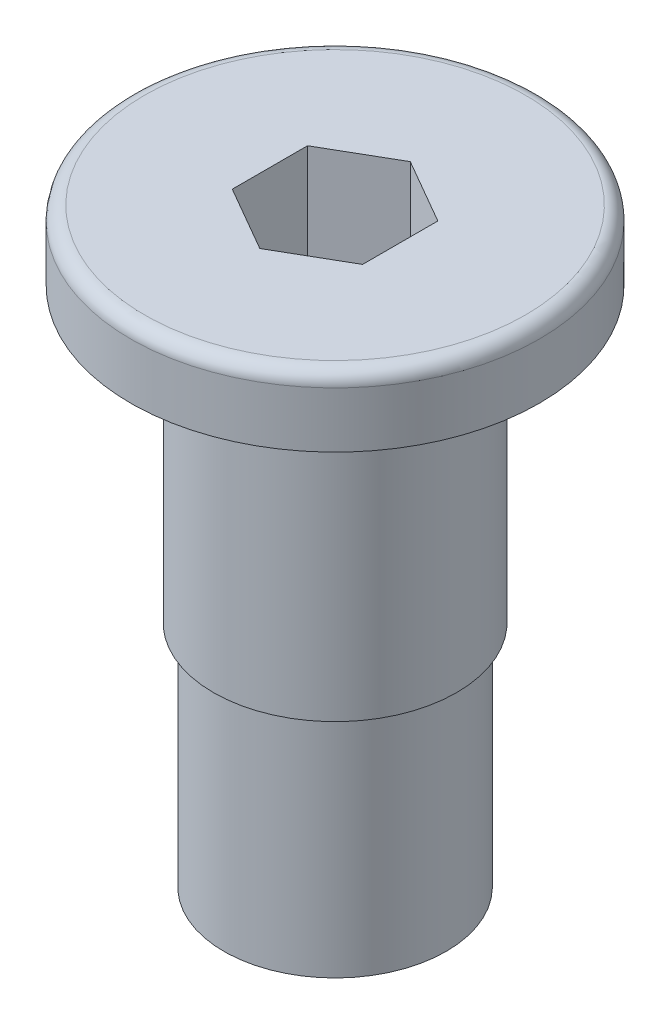
ISO-10303-21;
HEADER;
FILE_DESCRIPTION(('STEP AP214'),'2;1');
FILE_NAME('part.step','',(''),(''),'','','');
FILE_SCHEMA(('AUTOMOTIVE_DESIGN { 1 0 10303 214 1 1 1 1 }'));
ENDSEC;
DATA;
#1=APPLICATION_CONTEXT('core data for automotive mechanical design processes');
#2=APPLICATION_PROTOCOL_DEFINITION('international standard','automotive_design',2000,#1);
#3=PRODUCT_CONTEXT('',#1,'mechanical');
#4=PRODUCT('Part','Part','',(#3));
#5=PRODUCT_RELATED_PRODUCT_CATEGORY('part','',(#4));
#6=PRODUCT_DEFINITION_FORMATION('','',#4);
#7=PRODUCT_DEFINITION_CONTEXT('part definition',#1,'design');
#8=PRODUCT_DEFINITION('design','',#6,#7);
#9=PRODUCT_DEFINITION_SHAPE('','',#8);
#10=(LENGTH_UNIT() NAMED_UNIT(*) SI_UNIT(.MILLI.,.METRE.));
#11=(NAMED_UNIT(*) PLANE_ANGLE_UNIT() SI_UNIT($,.RADIAN.));
#12=(NAMED_UNIT(*) SI_UNIT($,.STERADIAN.) SOLID_ANGLE_UNIT());
#13=UNCERTAINTY_MEASURE_WITH_UNIT(LENGTH_MEASURE(1.E-05),#10,'distance_accuracy_value','');
#14=(GEOMETRIC_REPRESENTATION_CONTEXT(3) GLOBAL_UNCERTAINTY_ASSIGNED_CONTEXT((#13)) GLOBAL_UNIT_ASSIGNED_CONTEXT((#10,
#11,#12)) REPRESENTATION_CONTEXT('',''));
#15=CARTESIAN_POINT('',(0.,0.,0.));
#16=DIRECTION('',(0.,0.,1.));
#17=DIRECTION('',(1.,0.,0.));
#18=AXIS2_PLACEMENT_3D('',#15,#16,#17);
#19=CARTESIAN_POINT('',(0.,-1.27,1.3748153285078));
#20=DIRECTION('',(0.5,0.,0.866025403784439));
#21=DIRECTION('',(0.866025403784439,0.,-0.5));
#22=AXIS2_PLACEMENT_3D('',#19,#20,#21);
#23=PLANE('',#22);
#24=DIRECTION('',(0.,1.,0.));
#25=VECTOR('',#24,1.);
#26=CARTESIAN_POINT('',(1.190625,-1.27,0.687407664253899));
#27=LINE('',#26,#25);
#28=CARTESIAN_POINT('',(1.190625,1.27,0.6874076642539));
#29=VERTEX_POINT('',#28);
#30=CARTESIAN_POINT('',(1.190625,-1.27,0.687407664253899));
#31=VERTEX_POINT('',#30);
#32=EDGE_CURVE('E88',#29,#31,#27,.F.);
#33=ORIENTED_EDGE('',*,*,#32,.T.);
#34=DIRECTION('',(0.866025403784439,0.,-0.5));
#35=VECTOR('',#34,1.);
#36=CARTESIAN_POINT('',(0.,-1.27,1.3748153285078));
#37=LINE('',#36,#35);
#38=CARTESIAN_POINT('',(0.,-1.27,1.3748153285078));
#39=VERTEX_POINT('',#38);
#40=EDGE_CURVE('E77',#39,#31,#37,.T.);
#41=ORIENTED_EDGE('',*,*,#40,.F.);
#42=DIRECTION('',(0.,1.,0.));
#43=VECTOR('',#42,1.);
#44=CARTESIAN_POINT('',(0.,-1.27,1.3748153285078));
#45=LINE('',#44,#43);
#46=CARTESIAN_POINT('',(0.,1.27,1.3748153285078));
#47=VERTEX_POINT('',#46);
#48=EDGE_CURVE('E97',#39,#47,#45,.T.);
#49=ORIENTED_EDGE('',*,*,#48,.T.);
#50=DIRECTION('',(0.866025403784439,0.,-0.5));
#51=VECTOR('',#50,1.);
#52=CARTESIAN_POINT('',(0.,1.27,1.3748153285078));
#53=LINE('',#52,#51);
#54=EDGE_CURVE('E72',#29,#47,#53,.F.);
#55=ORIENTED_EDGE('',*,*,#54,.F.);
#56=EDGE_LOOP('',(#33,#41,#49,#55));
#57=FACE_BOUND('',#56,.T.);
#58=ADVANCED_FACE('F17',(#57),#23,.F.);
#59=CARTESIAN_POINT('',(1.190625,-1.27,0.687407664253899));
#60=DIRECTION('',(1.,0.,0.));
#61=DIRECTION('',(0.,1.,0.));
#62=AXIS2_PLACEMENT_3D('',#59,#60,#61);
#63=PLANE('',#62);
#64=DIRECTION('',(0.,1.,0.));
#65=VECTOR('',#64,1.);
#66=CARTESIAN_POINT('',(1.190625,-1.27,-0.687407664253897));
#67=LINE('',#66,#65);
#68=CARTESIAN_POINT('',(1.190625,1.27,-0.687407664253898));
#69=VERTEX_POINT('',#68);
#70=CARTESIAN_POINT('',(1.190625,-1.27,-0.687407664253898));
#71=VERTEX_POINT('',#70);
#72=EDGE_CURVE('E93',#69,#71,#67,.F.);
#73=ORIENTED_EDGE('',*,*,#72,.T.);
#74=DIRECTION('',(0.,0.,1.));
#75=VECTOR('',#74,1.);
#76=CARTESIAN_POINT('',(1.190625,-1.27,0.687407664253899));
#77=LINE('',#76,#75);
#78=EDGE_CURVE('E81',#31,#71,#77,.F.);
#79=ORIENTED_EDGE('',*,*,#78,.F.);
#80=ORIENTED_EDGE('',*,*,#32,.F.);
#81=DIRECTION('',(0.,0.,1.));
#82=VECTOR('',#81,1.);
#83=CARTESIAN_POINT('',(1.190625,1.27,0.687407664253899));
#84=LINE('',#83,#82);
#85=EDGE_CURVE('E95',#69,#29,#84,.T.);
#86=ORIENTED_EDGE('',*,*,#85,.F.);
#87=EDGE_LOOP('',(#73,#79,#80,#86));
#88=FACE_BOUND('',#87,.T.);
#89=ADVANCED_FACE('F91',(#88),#63,.F.);
#90=CARTESIAN_POINT('',(-1.190625,-1.27,0.687407664253898));
#91=DIRECTION('',(-0.5,0.,0.866025403784439));
#92=DIRECTION('',(0.866025403784439,0.,0.5));
#93=AXIS2_PLACEMENT_3D('',#90,#91,#92);
#94=PLANE('',#93);
#95=ORIENTED_EDGE('',*,*,#48,.F.);
#96=DIRECTION('',(0.866025403784439,0.,0.5));
#97=VECTOR('',#96,1.);
#98=CARTESIAN_POINT('',(-1.190625,-1.27,0.687407664253898));
#99=LINE('',#98,#97);
#100=CARTESIAN_POINT('',(-1.190625,-1.27,0.687407664253898));
#101=VERTEX_POINT('',#100);
#102=EDGE_CURVE('E84',#101,#39,#99,.T.);
#103=ORIENTED_EDGE('',*,*,#102,.F.);
#104=DIRECTION('',(0.,-1.,0.));
#105=VECTOR('',#104,1.);
#106=CARTESIAN_POINT('',(-1.190625,-1.27,0.687407664253898));
#107=LINE('',#106,#105);
#108=CARTESIAN_POINT('',(-1.190625,1.27,0.687407664253898));
#109=VERTEX_POINT('',#108);
#110=EDGE_CURVE('E158',#101,#109,#107,.F.);
#111=ORIENTED_EDGE('',*,*,#110,.T.);
#112=DIRECTION('',(0.866025403784439,0.,0.5));
#113=VECTOR('',#112,1.);
#114=CARTESIAN_POINT('',(-1.190625,1.27,0.687407664253897));
#115=LINE('',#114,#113);
#116=EDGE_CURVE('E170',#47,#109,#115,.F.);
#117=ORIENTED_EDGE('',*,*,#116,.F.);
#118=EDGE_LOOP('',(#95,#103,#111,#117));
#119=FACE_BOUND('',#118,.T.);
#120=ADVANCED_FACE('F173',(#119),#94,.F.);
#121=CARTESIAN_POINT('',(1.190625,-1.27,-0.687407664253898));
#122=DIRECTION('',(0.5,0.,-0.866025403784439));
#123=DIRECTION('',(-0.866025403784439,0.,-0.5));
#124=AXIS2_PLACEMENT_3D('',#121,#122,#123);
#125=PLANE('',#124);
#126=DIRECTION('',(0.,1.,0.));
#127=VECTOR('',#126,1.);
#128=CARTESIAN_POINT('',(0.,-1.27,-1.3748153285078));
#129=LINE('',#128,#127);
#130=CARTESIAN_POINT('',(0.,1.27,-1.3748153285078));
#131=VERTEX_POINT('',#130);
#132=CARTESIAN_POINT('',(0.,-1.27,-1.3748153285078));
#133=VERTEX_POINT('',#132);
#134=EDGE_CURVE('E153',#131,#133,#129,.F.);
#135=ORIENTED_EDGE('',*,*,#134,.T.);
#136=DIRECTION('',(-0.866025403784439,0.,-0.5));
#137=VECTOR('',#136,1.);
#138=CARTESIAN_POINT('',(1.190625,-1.27,-0.687407664253898));
#139=LINE('',#138,#137);
#140=EDGE_CURVE('E164',#71,#133,#139,.T.);
#141=ORIENTED_EDGE('',*,*,#140,.F.);
#142=ORIENTED_EDGE('',*,*,#72,.F.);
#143=DIRECTION('',(-0.866025403784439,0.,-0.5));
#144=VECTOR('',#143,1.);
#145=CARTESIAN_POINT('',(1.190625,1.27,-0.6874076642539));
#146=LINE('',#145,#144);
#147=EDGE_CURVE('E166',#131,#69,#146,.F.);
#148=ORIENTED_EDGE('',*,*,#147,.F.);
#149=EDGE_LOOP('',(#135,#141,#142,#148));
#150=FACE_BOUND('',#149,.T.);
#151=ADVANCED_FACE('F183',(#150),#125,.F.);
#152=CARTESIAN_POINT('',(0.,-1.27,-1.3748153285078));
#153=DIRECTION('',(0.,1.,0.));
#154=DIRECTION('',(-1.,0.,0.));
#155=AXIS2_PLACEMENT_3D('',#152,#153,#154);
#156=PLANE('',#155);
#157=ORIENTED_EDGE('',*,*,#40,.T.);
#158=ORIENTED_EDGE('',*,*,#78,.T.);
#159=ORIENTED_EDGE('',*,*,#140,.T.);
#160=DIRECTION('',(-0.866025403784439,0.,0.5));
#161=VECTOR('',#160,1.);
#162=CARTESIAN_POINT('',(0.,-1.27,-1.3748153285078));
#163=LINE('',#162,#161);
#164=CARTESIAN_POINT('',(-1.190625,-1.27,-0.687407664253899));
#165=VERTEX_POINT('',#164);
#166=EDGE_CURVE('E151',#133,#165,#163,.T.);
#167=ORIENTED_EDGE('',*,*,#166,.T.);
#168=DIRECTION('',(0.,0.,1.));
#169=VECTOR('',#168,1.);
#170=CARTESIAN_POINT('',(-1.190625,-1.27,-0.687407664253899));
#171=LINE('',#170,#169);
#172=EDGE_CURVE('E161',#165,#101,#171,.T.);
#173=ORIENTED_EDGE('',*,*,#172,.T.);
#174=ORIENTED_EDGE('',*,*,#102,.T.);
#175=EDGE_LOOP('',(#157,#158,#159,#167,#173,#174));
#176=FACE_BOUND('',#175,.T.);
#177=ADVANCED_FACE('F78',(#176),#156,.T.);
#178=CARTESIAN_POINT('',(-1.190625,-1.27,-0.687407664253899));
#179=DIRECTION('',(-1.,0.,0.));
#180=DIRECTION('',(0.,-1.,0.));
#181=AXIS2_PLACEMENT_3D('',#178,#179,#180);
#182=PLANE('',#181);
#183=ORIENTED_EDGE('',*,*,#110,.F.);
#184=ORIENTED_EDGE('',*,*,#172,.F.);
#185=DIRECTION('',(0.,1.,0.));
#186=VECTOR('',#185,1.);
#187=CARTESIAN_POINT('',(-1.190625,-1.27,-0.687407664253899));
#188=LINE('',#187,#186);
#189=CARTESIAN_POINT('',(-1.190625,1.27,-0.687407664253898));
#190=VERTEX_POINT('',#189);
#191=EDGE_CURVE('E142',#165,#190,#188,.T.);
#192=ORIENTED_EDGE('',*,*,#191,.T.);
#193=DIRECTION('',(0.,0.,1.));
#194=VECTOR('',#193,1.);
#195=CARTESIAN_POINT('',(-1.190625,1.27,-0.687407664253899));
#196=LINE('',#195,#194);
#197=EDGE_CURVE('E155',#109,#190,#196,.F.);
#198=ORIENTED_EDGE('',*,*,#197,.F.);
#199=EDGE_LOOP('',(#183,#184,#192,#198));
#200=FACE_BOUND('',#199,.T.);
#201=ADVANCED_FACE('F190',(#200),#182,.F.);
#202=CARTESIAN_POINT('',(0.,-1.27,-1.3748153285078));
#203=DIRECTION('',(-0.5,0.,-0.866025403784439));
#204=DIRECTION('',(-0.866025403784439,0.,0.5));
#205=AXIS2_PLACEMENT_3D('',#202,#203,#204);
#206=PLANE('',#205);
#207=ORIENTED_EDGE('',*,*,#191,.F.);
#208=ORIENTED_EDGE('',*,*,#166,.F.);
#209=ORIENTED_EDGE('',*,*,#134,.F.);
#210=DIRECTION('',(0.866025403784439,0.,-0.5));
#211=VECTOR('',#210,1.);
#212=CARTESIAN_POINT('',(-1.190625,1.27,-0.687407664253899));
#213=LINE('',#212,#211);
#214=EDGE_CURVE('E150',#190,#131,#213,.T.);
#215=ORIENTED_EDGE('',*,*,#214,.F.);
#216=EDGE_LOOP('',(#207,#208,#209,#215));
#217=FACE_BOUND('',#216,.T.);
#218=ADVANCED_FACE('F188',(#217),#206,.F.);
#219=CARTESIAN_POINT('',(0.,1.27,0.));
#220=DIRECTION('',(0.,1.,0.));
#221=DIRECTION('',(-1.,0.,0.));
#222=AXIS2_PLACEMENT_3D('',#219,#220,#221);
#223=PLANE('',#222);
#224=ORIENTED_EDGE('',*,*,#197,.T.);
#225=ORIENTED_EDGE('',*,*,#214,.T.);
#226=ORIENTED_EDGE('',*,*,#147,.T.);
#227=ORIENTED_EDGE('',*,*,#85,.T.);
#228=ORIENTED_EDGE('',*,*,#54,.T.);
#229=ORIENTED_EDGE('',*,*,#116,.T.);
#230=EDGE_LOOP('',(#224,#225,#226,#227,#228,#229));
#231=FACE_BOUND('',#230,.T.);
#232=CARTESIAN_POINT('',(0.,1.27,0.));
#233=DIRECTION('',(0.,-1.,0.));
#234=DIRECTION('',(1.,0.,0.));
#235=AXIS2_PLACEMENT_3D('',#232,#233,#234);
#236=CIRCLE('',#235,3.4798);
#237=CARTESIAN_POINT('',(3.47980000000001,1.27,0.));
#238=VERTEX_POINT('',#237);
#239=CARTESIAN_POINT('',(-3.47979999999999,1.27000000000001,0.));
#240=VERTEX_POINT('',#239);
#241=EDGE_CURVE('E36',#238,#240,#236,.T.);
#242=ORIENTED_EDGE('',*,*,#241,.F.);
#243=CARTESIAN_POINT('',(0.,1.27,0.));
#244=DIRECTION('',(0.,-1.,0.));
#245=DIRECTION('',(-1.,0.,0.));
#246=AXIS2_PLACEMENT_3D('',#243,#244,#245);
#247=CIRCLE('',#246,3.4798);
#248=EDGE_CURVE('E116',#240,#238,#247,.T.);
#249=ORIENTED_EDGE('',*,*,#248,.F.);
#250=EDGE_LOOP('',(#242,#249));
#251=FACE_BOUND('',#250,.T.);
#252=ADVANCED_FACE('F130',(#231,#251),#223,.T.);
#253=CARTESIAN_POINT('',(0.,1.016,0.));
#254=DIRECTION('',(0.,1.,0.));
#255=DIRECTION('',(-1.,0.,0.));
#256=AXIS2_PLACEMENT_3D('',#253,#254,#255);
#257=TOROIDAL_SURFACE('',#256,3.4798,0.254);
#258=CARTESIAN_POINT('',(0.,1.016,0.));
#259=DIRECTION('',(0.,-1.,0.));
#260=DIRECTION('',(1.,0.,0.));
#261=AXIS2_PLACEMENT_3D('',#258,#259,#260);
#262=CIRCLE('',#261,3.7338);
#263=CARTESIAN_POINT('',(3.73380000000001,1.016,0.));
#264=VERTEX_POINT('',#263);
#265=EDGE_CURVE('E112',#264,#264,#262,.T.);
#266=ORIENTED_EDGE('',*,*,#265,.F.);
#267=EDGE_LOOP('',(#266));
#268=FACE_BOUND('',#267,.T.);
#269=ORIENTED_EDGE('',*,*,#248,.T.);
#270=ORIENTED_EDGE('',*,*,#241,.T.);
#271=EDGE_LOOP('',(#269,#270));
#272=FACE_BOUND('',#271,.T.);
#273=ADVANCED_FACE('F124',(#268,#272),#257,.T.);
#274=CARTESIAN_POINT('',(2.032,-9.525,0.));
#275=DIRECTION('',(0.,-1.,0.));
#276=DIRECTION('',(1.,0.,0.));
#277=AXIS2_PLACEMENT_3D('',#274,#275,#276);
#278=PLANE('',#277);
#279=CARTESIAN_POINT('',(0.,-9.525,0.));
#280=DIRECTION('',(0.,-1.,0.));
#281=DIRECTION('',(1.,0.,0.));
#282=AXIS2_PLACEMENT_3D('',#279,#280,#281);
#283=CIRCLE('',#282,2.032);
#284=CARTESIAN_POINT('',(2.032,-9.525,0.));
#285=VERTEX_POINT('',#284);
#286=EDGE_CURVE('E110',#285,#285,#283,.F.);
#287=ORIENTED_EDGE('',*,*,#286,.F.);
#288=EDGE_LOOP('',(#287));
#289=FACE_BOUND('',#288,.T.);
#290=ADVANCED_FACE('F129',(#289),#278,.T.);
#291=CARTESIAN_POINT('',(0.,-9.525,0.));
#292=DIRECTION('',(0.,-1.,0.));
#293=DIRECTION('',(1.,0.,0.));
#294=AXIS2_PLACEMENT_3D('',#291,#292,#293);
#295=CYLINDRICAL_SURFACE('',#294,3.7338);
#296=ORIENTED_EDGE('',*,*,#265,.T.);
#297=EDGE_LOOP('',(#296));
#298=FACE_BOUND('',#297,.T.);
#299=CARTESIAN_POINT('',(0.,0.,0.));
#300=DIRECTION('',(0.,-1.,0.));
#301=DIRECTION('',(1.,0.,0.));
#302=AXIS2_PLACEMENT_3D('',#299,#300,#301);
#303=CIRCLE('',#302,3.7338);
#304=CARTESIAN_POINT('',(3.73380000000001,0.,0.));
#305=VERTEX_POINT('',#304);
#306=EDGE_CURVE('E107',#305,#305,#303,.T.);
#307=ORIENTED_EDGE('',*,*,#306,.F.);
#308=EDGE_LOOP('',(#307));
#309=FACE_BOUND('',#308,.T.);
#310=ADVANCED_FACE('F217',(#298,#309),#295,.T.);
#311=CARTESIAN_POINT('',(0.,-9.525,0.));
#312=DIRECTION('',(0.,-1.,0.));
#313=DIRECTION('',(1.,0.,0.));
#314=AXIS2_PLACEMENT_3D('',#311,#312,#313);
#315=CYLINDRICAL_SURFACE('',#314,2.032);
#316=CARTESIAN_POINT('',(0.,-5.334,0.));
#317=DIRECTION('',(0.,-1.,0.));
#318=DIRECTION('',(1.,0.,0.));
#319=AXIS2_PLACEMENT_3D('',#316,#317,#318);
#320=CIRCLE('',#319,2.032);
#321=CARTESIAN_POINT('',(2.032,-5.334,0.));
#322=VERTEX_POINT('',#321);
#323=EDGE_CURVE('E104',#322,#322,#320,.F.);
#324=ORIENTED_EDGE('',*,*,#323,.F.);
#325=EDGE_LOOP('',(#324));
#326=FACE_BOUND('',#325,.T.);
#327=ORIENTED_EDGE('',*,*,#286,.T.);
#328=EDGE_LOOP('',(#327));
#329=FACE_BOUND('',#328,.T.);
#330=ADVANCED_FACE('F214',(#326,#329),#315,.T.);
#331=CARTESIAN_POINT('',(3.73380000000001,0.,0.));
#332=DIRECTION('',(0.,-1.,0.));
#333=DIRECTION('',(1.,0.,0.));
#334=AXIS2_PLACEMENT_3D('',#331,#332,#333);
#335=PLANE('',#334);
#336=CARTESIAN_POINT('',(0.,0.,0.));
#337=DIRECTION('',(0.,-1.,0.));
#338=DIRECTION('',(1.,0.,0.));
#339=AXIS2_PLACEMENT_3D('',#336,#337,#338);
#340=CIRCLE('',#339,2.22249999999999);
#341=CARTESIAN_POINT('',(2.2225,0.,0.));
#342=VERTEX_POINT('',#341);
#343=EDGE_CURVE('E28',#342,#342,#340,.T.);
#344=ORIENTED_EDGE('',*,*,#343,.F.);
#345=EDGE_LOOP('',(#344));
#346=FACE_BOUND('',#345,.T.);
#347=ORIENTED_EDGE('',*,*,#306,.T.);
#348=EDGE_LOOP('',(#347));
#349=FACE_BOUND('',#348,.T.);
#350=ADVANCED_FACE('F207',(#346,#349),#335,.T.);
#351=CARTESIAN_POINT('',(2.2225,-5.334,0.));
#352=DIRECTION('',(0.,-1.,0.));
#353=DIRECTION('',(1.,0.,0.));
#354=AXIS2_PLACEMENT_3D('',#351,#352,#353);
#355=PLANE('',#354);
#356=ORIENTED_EDGE('',*,*,#323,.T.);
#357=EDGE_LOOP('',(#356));
#358=FACE_BOUND('',#357,.T.);
#359=CARTESIAN_POINT('',(0.,-5.334,0.));
#360=DIRECTION('',(0.,-1.,0.));
#361=DIRECTION('',(1.,0.,0.));
#362=AXIS2_PLACEMENT_3D('',#359,#360,#361);
#363=CIRCLE('',#362,2.22249999999999);
#364=CARTESIAN_POINT('',(2.2225,-5.334,0.));
#365=VERTEX_POINT('',#364);
#366=EDGE_CURVE('E10',#365,#365,#363,.F.);
#367=ORIENTED_EDGE('',*,*,#366,.F.);
#368=EDGE_LOOP('',(#367));
#369=FACE_BOUND('',#368,.T.);
#370=ADVANCED_FACE('F201',(#358,#369),#355,.T.);
#371=CARTESIAN_POINT('',(0.,-9.525,0.));
#372=DIRECTION('',(0.,-1.,0.));
#373=DIRECTION('',(1.,0.,0.));
#374=AXIS2_PLACEMENT_3D('',#371,#372,#373);
#375=CYLINDRICAL_SURFACE('',#374,2.22249999999999);
#376=ORIENTED_EDGE('',*,*,#366,.T.);
#377=EDGE_LOOP('',(#376));
#378=FACE_BOUND('',#377,.T.);
#379=ORIENTED_EDGE('',*,*,#343,.T.);
#380=EDGE_LOOP('',(#379));
#381=FACE_BOUND('',#380,.T.);
#382=ADVANCED_FACE('F199',(#378,#381),#375,.T.);
#383=CLOSED_SHELL('',(#58,#89,#120,#151,#177,#201,#218,#252,#273,#290,#310,#330,#350,#370,#382));
#384=MANIFOLD_SOLID_BREP('B1',#383);
#385=ADVANCED_BREP_SHAPE_REPRESENTATION('',(#18,#384),#14);
#386=SHAPE_DEFINITION_REPRESENTATION(#9,#385);
ENDSEC;
END-ISO-10303-21;
